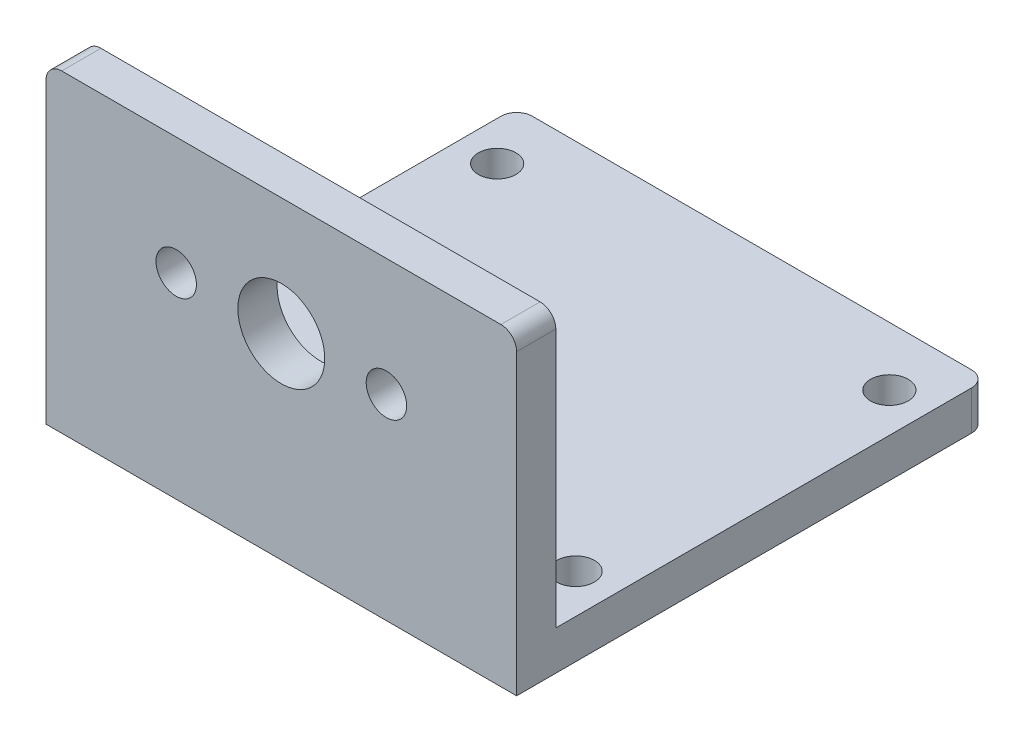
ISO-10303-21;
HEADER;
FILE_DESCRIPTION(('STEP AP214'),'2;1');
FILE_NAME('part.step','',(''),(''),'','','');
FILE_SCHEMA(('AUTOMOTIVE_DESIGN { 1 0 10303 214 1 1 1 1 }'));
ENDSEC;
DATA;
#1=APPLICATION_CONTEXT('core data for automotive mechanical design processes');
#2=APPLICATION_PROTOCOL_DEFINITION('international standard','automotive_design',2000,#1);
#3=PRODUCT_CONTEXT('',#1,'mechanical');
#4=PRODUCT('Part','Part','',(#3));
#5=PRODUCT_RELATED_PRODUCT_CATEGORY('part','',(#4));
#6=PRODUCT_DEFINITION_FORMATION('','',#4);
#7=PRODUCT_DEFINITION_CONTEXT('part definition',#1,'design');
#8=PRODUCT_DEFINITION('design','',#6,#7);
#9=PRODUCT_DEFINITION_SHAPE('','',#8);
#10=(LENGTH_UNIT() NAMED_UNIT(*) SI_UNIT(.MILLI.,.METRE.));
#11=(NAMED_UNIT(*) PLANE_ANGLE_UNIT() SI_UNIT($,.RADIAN.));
#12=(NAMED_UNIT(*) SI_UNIT($,.STERADIAN.) SOLID_ANGLE_UNIT());
#13=UNCERTAINTY_MEASURE_WITH_UNIT(LENGTH_MEASURE(1.E-05),#10,'distance_accuracy_value','');
#14=(GEOMETRIC_REPRESENTATION_CONTEXT(3) GLOBAL_UNCERTAINTY_ASSIGNED_CONTEXT((#13)) GLOBAL_UNIT_ASSIGNED_CONTEXT((#10,
#11,#12)) REPRESENTATION_CONTEXT('',''));
#15=CARTESIAN_POINT('',(0.,0.,0.));
#16=DIRECTION('',(0.,0.,1.));
#17=DIRECTION('',(1.,0.,0.));
#18=AXIS2_PLACEMENT_3D('',#15,#16,#17);
#19=CARTESIAN_POINT('',(38.1,25.4,0.));
#20=DIRECTION('',(0.,0.,-1.));
#21=DIRECTION('',(0.,1.,0.));
#22=AXIS2_PLACEMENT_3D('',#19,#20,#21);
#23=PLANE('',#22);
#24=CARTESIAN_POINT('',(27.559,15.875,0.));
#25=DIRECTION('',(0.,0.,-1.));
#26=DIRECTION('',(-1.,0.,0.));
#27=AXIS2_PLACEMENT_3D('',#24,#25,#26);
#28=CIRCLE('',#27,1.6383);
#29=CARTESIAN_POINT('',(25.9207,15.875,0.));
#30=VERTEX_POINT('',#29);
#31=EDGE_CURVE('E312',#30,#30,#28,.T.);
#32=ORIENTED_EDGE('',*,*,#31,.T.);
#33=EDGE_LOOP('',(#32));
#34=FACE_BOUND('',#33,.T.);
#35=CARTESIAN_POINT('',(10.541,15.875,0.));
#36=DIRECTION('',(0.,0.,-1.));
#37=DIRECTION('',(-1.,0.,0.));
#38=AXIS2_PLACEMENT_3D('',#35,#36,#37);
#39=CIRCLE('',#38,1.6383);
#40=CARTESIAN_POINT('',(8.9027,15.875,0.));
#41=VERTEX_POINT('',#40);
#42=EDGE_CURVE('E317',#41,#41,#39,.T.);
#43=ORIENTED_EDGE('',*,*,#42,.T.);
#44=EDGE_LOOP('',(#43));
#45=FACE_BOUND('',#44,.T.);
#46=CARTESIAN_POINT('',(19.05,15.875,0.));
#47=DIRECTION('',(0.,0.,-1.));
#48=DIRECTION('',(-1.,0.,0.));
#49=AXIS2_PLACEMENT_3D('',#46,#47,#48);
#50=CIRCLE('',#49,3.5179);
#51=CARTESIAN_POINT('',(15.5321,15.875,0.));
#52=VERTEX_POINT('',#51);
#53=EDGE_CURVE('E211',#52,#52,#50,.T.);
#54=ORIENTED_EDGE('',*,*,#53,.T.);
#55=EDGE_LOOP('',(#54));
#56=FACE_BOUND('',#55,.T.);
#57=DIRECTION('',(-1.,0.,0.));
#58=VECTOR('',#57,1.);
#59=CARTESIAN_POINT('',(38.1,25.4,0.));
#60=LINE('',#59,#58);
#61=CARTESIAN_POINT('',(36.83,25.4,0.));
#62=VERTEX_POINT('',#61);
#63=CARTESIAN_POINT('',(1.27000000000001,25.4,0.));
#64=VERTEX_POINT('',#63);
#65=EDGE_CURVE('E186',#62,#64,#60,.T.);
#66=ORIENTED_EDGE('',*,*,#65,.T.);
#67=CARTESIAN_POINT('',(1.27,24.13,0.));
#68=DIRECTION('',(0.,0.,-1.));
#69=DIRECTION('',(0.,1.,0.));
#70=AXIS2_PLACEMENT_3D('',#67,#68,#69);
#71=CIRCLE('',#70,1.27);
#72=CARTESIAN_POINT('',(0.,24.13,0.));
#73=VERTEX_POINT('',#72);
#74=EDGE_CURVE('E176',#64,#73,#71,.F.);
#75=ORIENTED_EDGE('',*,*,#74,.T.);
#76=DIRECTION('',(0.,-1.,0.));
#77=VECTOR('',#76,1.);
#78=CARTESIAN_POINT('',(0.,25.4,0.));
#79=LINE('',#78,#77);
#80=CARTESIAN_POINT('',(0.,0.,0.));
#81=VERTEX_POINT('',#80);
#82=EDGE_CURVE('E142',#73,#81,#79,.T.);
#83=ORIENTED_EDGE('',*,*,#82,.T.);
#84=DIRECTION('',(-1.,0.,0.));
#85=VECTOR('',#84,1.);
#86=CARTESIAN_POINT('',(38.1,0.,0.));
#87=LINE('',#86,#85);
#88=CARTESIAN_POINT('',(38.1,0.,0.));
#89=VERTEX_POINT('',#88);
#90=EDGE_CURVE('E134',#89,#81,#87,.T.);
#91=ORIENTED_EDGE('',*,*,#90,.F.);
#92=DIRECTION('',(0.,-1.,0.));
#93=VECTOR('',#92,1.);
#94=CARTESIAN_POINT('',(38.1,25.4,0.));
#95=LINE('',#94,#93);
#96=CARTESIAN_POINT('',(38.1,24.13,0.));
#97=VERTEX_POINT('',#96);
#98=EDGE_CURVE('E117',#97,#89,#95,.T.);
#99=ORIENTED_EDGE('',*,*,#98,.F.);
#100=CARTESIAN_POINT('',(36.83,24.13,0.));
#101=DIRECTION('',(0.,0.,-1.));
#102=DIRECTION('',(0.,1.,0.));
#103=AXIS2_PLACEMENT_3D('',#100,#101,#102);
#104=CIRCLE('',#103,1.27);
#105=EDGE_CURVE('E174',#97,#62,#104,.F.);
#106=ORIENTED_EDGE('',*,*,#105,.T.);
#107=EDGE_LOOP('',(#66,#75,#83,#91,#99,#106));
#108=FACE_BOUND('',#107,.T.);
#109=ADVANCED_FACE('F39',(#34,#45,#56,#108),#23,.F.);
#110=CARTESIAN_POINT('',(38.1,0.,0.));
#111=DIRECTION('',(0.,1.,0.));
#112=DIRECTION('',(0.,0.,1.));
#113=AXIS2_PLACEMENT_3D('',#110,#111,#112);
#114=PLANE('',#113);
#115=CARTESIAN_POINT('',(34.925,0.,-7.9502));
#116=DIRECTION('',(0.,1.,0.));
#117=DIRECTION('',(0.,0.,1.));
#118=AXIS2_PLACEMENT_3D('',#115,#116,#117);
#119=CIRCLE('',#118,1.524);
#120=CARTESIAN_POINT('',(34.925,0.,-6.42620000000001));
#121=VERTEX_POINT('',#120);
#122=EDGE_CURVE('E286',#121,#121,#119,.T.);
#123=ORIENTED_EDGE('',*,*,#122,.T.);
#124=EDGE_LOOP('',(#123));
#125=FACE_BOUND('',#124,.T.);
#126=CARTESIAN_POINT('',(34.925,0.,-33.3502));
#127=DIRECTION('',(0.,1.,0.));
#128=DIRECTION('',(0.,0.,1.));
#129=AXIS2_PLACEMENT_3D('',#126,#127,#128);
#130=CIRCLE('',#129,1.524);
#131=CARTESIAN_POINT('',(34.925,0.,-31.8262));
#132=VERTEX_POINT('',#131);
#133=EDGE_CURVE('E294',#132,#132,#130,.T.);
#134=ORIENTED_EDGE('',*,*,#133,.T.);
#135=EDGE_LOOP('',(#134));
#136=FACE_BOUND('',#135,.T.);
#137=CARTESIAN_POINT('',(3.175,0.,-33.3502));
#138=DIRECTION('',(0.,1.,0.));
#139=DIRECTION('',(0.,0.,1.));
#140=AXIS2_PLACEMENT_3D('',#137,#138,#139);
#141=CIRCLE('',#140,1.524);
#142=CARTESIAN_POINT('',(3.175,0.,-31.8262));
#143=VERTEX_POINT('',#142);
#144=EDGE_CURVE('E300',#143,#143,#141,.T.);
#145=ORIENTED_EDGE('',*,*,#144,.T.);
#146=EDGE_LOOP('',(#145));
#147=FACE_BOUND('',#146,.T.);
#148=CARTESIAN_POINT('',(3.175,0.,-7.9502));
#149=DIRECTION('',(0.,1.,0.));
#150=DIRECTION('',(0.,0.,1.));
#151=AXIS2_PLACEMENT_3D('',#148,#149,#150);
#152=CIRCLE('',#151,1.524);
#153=CARTESIAN_POINT('',(3.175,0.,-6.4262));
#154=VERTEX_POINT('',#153);
#155=EDGE_CURVE('E306',#154,#154,#152,.T.);
#156=ORIENTED_EDGE('',*,*,#155,.T.);
#157=EDGE_LOOP('',(#156));
#158=FACE_BOUND('',#157,.T.);
#159=DIRECTION('',(0.,0.,-1.));
#160=VECTOR('',#159,1.);
#161=CARTESIAN_POINT('',(0.,0.,0.));
#162=LINE('',#161,#160);
#163=CARTESIAN_POINT('',(0.,0.,-36.83));
#164=VERTEX_POINT('',#163);
#165=EDGE_CURVE('E210',#81,#164,#162,.T.);
#166=ORIENTED_EDGE('',*,*,#165,.T.);
#167=CARTESIAN_POINT('',(1.27,0.,-36.83));
#168=DIRECTION('',(0.,1.,0.));
#169=DIRECTION('',(0.,0.,1.));
#170=AXIS2_PLACEMENT_3D('',#167,#168,#169);
#171=CIRCLE('',#170,1.27);
#172=CARTESIAN_POINT('',(1.27000000000001,0.,-38.1));
#173=VERTEX_POINT('',#172);
#174=EDGE_CURVE('E165',#164,#173,#171,.F.);
#175=ORIENTED_EDGE('',*,*,#174,.T.);
#176=DIRECTION('',(-1.,0.,0.));
#177=VECTOR('',#176,1.);
#178=CARTESIAN_POINT('',(38.1,0.,-38.1));
#179=LINE('',#178,#177);
#180=CARTESIAN_POINT('',(36.83,0.,-38.1));
#181=VERTEX_POINT('',#180);
#182=EDGE_CURVE('E145',#181,#173,#179,.T.);
#183=ORIENTED_EDGE('',*,*,#182,.F.);
#184=CARTESIAN_POINT('',(36.83,0.,-36.83));
#185=DIRECTION('',(0.,1.,0.));
#186=DIRECTION('',(0.,0.,1.));
#187=AXIS2_PLACEMENT_3D('',#184,#185,#186);
#188=CIRCLE('',#187,1.27);
#189=CARTESIAN_POINT('',(38.1,0.,-36.83));
#190=VERTEX_POINT('',#189);
#191=EDGE_CURVE('E137',#181,#190,#188,.F.);
#192=ORIENTED_EDGE('',*,*,#191,.T.);
#193=DIRECTION('',(0.,0.,-1.));
#194=VECTOR('',#193,1.);
#195=CARTESIAN_POINT('',(38.1,0.,0.));
#196=LINE('',#195,#194);
#197=EDGE_CURVE('E121',#89,#190,#196,.T.);
#198=ORIENTED_EDGE('',*,*,#197,.F.);
#199=ORIENTED_EDGE('',*,*,#90,.T.);
#200=EDGE_LOOP('',(#166,#175,#183,#192,#198,#199));
#201=FACE_BOUND('',#200,.T.);
#202=ADVANCED_FACE('F133',(#125,#136,#147,#158,#201),#114,.F.);
#203=CARTESIAN_POINT('',(38.1,0.,-38.1));
#204=DIRECTION('',(0.,0.,1.));
#205=DIRECTION('',(1.,0.,0.));
#206=AXIS2_PLACEMENT_3D('',#203,#204,#205);
#207=PLANE('',#206);
#208=ORIENTED_EDGE('',*,*,#182,.T.);
#209=DIRECTION('',(0.,1.,0.));
#210=VECTOR('',#209,1.);
#211=CARTESIAN_POINT('',(1.27,0.,-38.1));
#212=LINE('',#211,#210);
#213=CARTESIAN_POINT('',(1.27000000000001,3.175,-38.1));
#214=VERTEX_POINT('',#213);
#215=EDGE_CURVE('E147',#173,#214,#212,.T.);
#216=ORIENTED_EDGE('',*,*,#215,.T.);
#217=DIRECTION('',(-1.,0.,0.));
#218=VECTOR('',#217,1.);
#219=CARTESIAN_POINT('',(38.1,3.175,-38.1));
#220=LINE('',#219,#218);
#221=CARTESIAN_POINT('',(36.83,3.175,-38.1));
#222=VERTEX_POINT('',#221);
#223=EDGE_CURVE('E150',#222,#214,#220,.T.);
#224=ORIENTED_EDGE('',*,*,#223,.F.);
#225=DIRECTION('',(0.,1.,0.));
#226=VECTOR('',#225,1.);
#227=CARTESIAN_POINT('',(36.83,0.,-38.1));
#228=LINE('',#227,#226);
#229=EDGE_CURVE('E144',#222,#181,#228,.F.);
#230=ORIENTED_EDGE('',*,*,#229,.T.);
#231=EDGE_LOOP('',(#208,#216,#224,#230));
#232=FACE_BOUND('',#231,.T.);
#233=ADVANCED_FACE('F203',(#232),#207,.F.);
#234=CARTESIAN_POINT('',(38.1,3.175,-38.1));
#235=DIRECTION('',(0.,-1.,0.));
#236=DIRECTION('',(0.,0.,-1.));
#237=AXIS2_PLACEMENT_3D('',#234,#235,#236);
#238=PLANE('',#237);
#239=CARTESIAN_POINT('',(34.925,3.175,-7.9502));
#240=DIRECTION('',(0.,1.,0.));
#241=DIRECTION('',(0.,0.,1.));
#242=AXIS2_PLACEMENT_3D('',#239,#240,#241);
#243=CIRCLE('',#242,1.524);
#244=CARTESIAN_POINT('',(34.925,3.175,-6.42620000000001));
#245=VERTEX_POINT('',#244);
#246=EDGE_CURVE('E289',#245,#245,#243,.T.);
#247=ORIENTED_EDGE('',*,*,#246,.F.);
#248=EDGE_LOOP('',(#247));
#249=FACE_BOUND('',#248,.T.);
#250=CARTESIAN_POINT('',(34.925,3.175,-33.3502));
#251=DIRECTION('',(0.,1.,0.));
#252=DIRECTION('',(0.,0.,1.));
#253=AXIS2_PLACEMENT_3D('',#250,#251,#252);
#254=CIRCLE('',#253,1.524);
#255=CARTESIAN_POINT('',(34.925,3.175,-31.8262));
#256=VERTEX_POINT('',#255);
#257=EDGE_CURVE('E291',#256,#256,#254,.T.);
#258=ORIENTED_EDGE('',*,*,#257,.F.);
#259=EDGE_LOOP('',(#258));
#260=FACE_BOUND('',#259,.T.);
#261=CARTESIAN_POINT('',(3.175,3.175,-33.3502));
#262=DIRECTION('',(0.,1.,0.));
#263=DIRECTION('',(0.,0.,1.));
#264=AXIS2_PLACEMENT_3D('',#261,#262,#263);
#265=CIRCLE('',#264,1.524);
#266=CARTESIAN_POINT('',(3.175,3.175,-31.8262));
#267=VERTEX_POINT('',#266);
#268=EDGE_CURVE('E297',#267,#267,#265,.T.);
#269=ORIENTED_EDGE('',*,*,#268,.F.);
#270=EDGE_LOOP('',(#269));
#271=FACE_BOUND('',#270,.T.);
#272=CARTESIAN_POINT('',(3.175,3.175,-7.9502));
#273=DIRECTION('',(0.,1.,0.));
#274=DIRECTION('',(0.,0.,1.));
#275=AXIS2_PLACEMENT_3D('',#272,#273,#274);
#276=CIRCLE('',#275,1.524);
#277=CARTESIAN_POINT('',(3.175,3.175,-6.4262));
#278=VERTEX_POINT('',#277);
#279=EDGE_CURVE('E303',#278,#278,#276,.T.);
#280=ORIENTED_EDGE('',*,*,#279,.F.);
#281=EDGE_LOOP('',(#280));
#282=FACE_BOUND('',#281,.T.);
#283=ORIENTED_EDGE('',*,*,#223,.T.);
#284=CARTESIAN_POINT('',(1.27,3.175,-36.83));
#285=DIRECTION('',(0.,-1.,0.));
#286=DIRECTION('',(0.,0.,-1.));
#287=AXIS2_PLACEMENT_3D('',#284,#285,#286);
#288=CIRCLE('',#287,1.27);
#289=CARTESIAN_POINT('',(0.,3.175,-36.83));
#290=VERTEX_POINT('',#289);
#291=EDGE_CURVE('E158',#214,#290,#288,.F.);
#292=ORIENTED_EDGE('',*,*,#291,.T.);
#293=DIRECTION('',(0.,0.,1.));
#294=VECTOR('',#293,1.);
#295=CARTESIAN_POINT('',(0.,3.175,-38.1));
#296=LINE('',#295,#294);
#297=CARTESIAN_POINT('',(0.,3.175,-3.175));
#298=VERTEX_POINT('',#297);
#299=EDGE_CURVE('E212',#290,#298,#296,.T.);
#300=ORIENTED_EDGE('',*,*,#299,.T.);
#301=DIRECTION('',(-1.,0.,0.));
#302=VECTOR('',#301,1.);
#303=CARTESIAN_POINT('',(38.1,3.175,-3.175));
#304=LINE('',#303,#302);
#305=CARTESIAN_POINT('',(38.1,3.175,-3.175));
#306=VERTEX_POINT('',#305);
#307=EDGE_CURVE('E191',#306,#298,#304,.T.);
#308=ORIENTED_EDGE('',*,*,#307,.F.);
#309=DIRECTION('',(0.,0.,1.));
#310=VECTOR('',#309,1.);
#311=CARTESIAN_POINT('',(38.1,3.175,-38.1));
#312=LINE('',#311,#310);
#313=CARTESIAN_POINT('',(38.1,3.175,-36.83));
#314=VERTEX_POINT('',#313);
#315=EDGE_CURVE('E138',#314,#306,#312,.T.);
#316=ORIENTED_EDGE('',*,*,#315,.F.);
#317=CARTESIAN_POINT('',(36.83,3.175,-36.83));
#318=DIRECTION('',(0.,-1.,0.));
#319=DIRECTION('',(0.,0.,-1.));
#320=AXIS2_PLACEMENT_3D('',#317,#318,#319);
#321=CIRCLE('',#320,1.27);
#322=EDGE_CURVE('E156',#314,#222,#321,.F.);
#323=ORIENTED_EDGE('',*,*,#322,.T.);
#324=EDGE_LOOP('',(#283,#292,#300,#308,#316,#323));
#325=FACE_BOUND('',#324,.T.);
#326=ADVANCED_FACE('F199',(#249,#260,#271,#282,#325),#238,.F.);
#327=CARTESIAN_POINT('',(38.1,3.175,-3.175));
#328=DIRECTION('',(0.,0.,1.));
#329=DIRECTION('',(1.,0.,0.));
#330=AXIS2_PLACEMENT_3D('',#327,#328,#329);
#331=PLANE('',#330);
#332=CARTESIAN_POINT('',(27.559,15.875,-3.175));
#333=DIRECTION('',(0.,0.,-1.));
#334=DIRECTION('',(-1.,0.,0.));
#335=AXIS2_PLACEMENT_3D('',#332,#333,#334);
#336=CIRCLE('',#335,1.6383);
#337=CARTESIAN_POINT('',(25.9207,15.875,-3.175));
#338=VERTEX_POINT('',#337);
#339=EDGE_CURVE('E309',#338,#338,#336,.T.);
#340=ORIENTED_EDGE('',*,*,#339,.F.);
#341=EDGE_LOOP('',(#340));
#342=FACE_BOUND('',#341,.T.);
#343=CARTESIAN_POINT('',(10.541,15.875,-3.175));
#344=DIRECTION('',(0.,0.,-1.));
#345=DIRECTION('',(-1.,0.,0.));
#346=AXIS2_PLACEMENT_3D('',#343,#344,#345);
#347=CIRCLE('',#346,1.6383);
#348=CARTESIAN_POINT('',(8.9027,15.875,-3.175));
#349=VERTEX_POINT('',#348);
#350=EDGE_CURVE('E314',#349,#349,#347,.T.);
#351=ORIENTED_EDGE('',*,*,#350,.F.);
#352=EDGE_LOOP('',(#351));
#353=FACE_BOUND('',#352,.T.);
#354=CARTESIAN_POINT('',(19.05,15.875,-3.175));
#355=DIRECTION('',(0.,0.,-1.));
#356=DIRECTION('',(-1.,0.,0.));
#357=AXIS2_PLACEMENT_3D('',#354,#355,#356);
#358=CIRCLE('',#357,3.5179);
#359=CARTESIAN_POINT('',(15.5321,15.875,-3.175));
#360=VERTEX_POINT('',#359);
#361=EDGE_CURVE('E320',#360,#360,#358,.T.);
#362=ORIENTED_EDGE('',*,*,#361,.F.);
#363=EDGE_LOOP('',(#362));
#364=FACE_BOUND('',#363,.T.);
#365=DIRECTION('',(0.,1.,0.));
#366=VECTOR('',#365,1.);
#367=CARTESIAN_POINT('',(0.,3.175,-3.175));
#368=LINE('',#367,#366);
#369=CARTESIAN_POINT('',(0.,24.13,-3.175));
#370=VERTEX_POINT('',#369);
#371=EDGE_CURVE('E128',#298,#370,#368,.T.);
#372=ORIENTED_EDGE('',*,*,#371,.T.);
#373=CARTESIAN_POINT('',(1.27,24.13,-3.175));
#374=DIRECTION('',(0.,0.,1.));
#375=DIRECTION('',(1.,0.,0.));
#376=AXIS2_PLACEMENT_3D('',#373,#374,#375);
#377=CIRCLE('',#376,1.27);
#378=CARTESIAN_POINT('',(1.27000000000001,25.4,-3.175));
#379=VERTEX_POINT('',#378);
#380=EDGE_CURVE('E11',#370,#379,#377,.F.);
#381=ORIENTED_EDGE('',*,*,#380,.T.);
#382=DIRECTION('',(-1.,0.,0.));
#383=VECTOR('',#382,1.);
#384=CARTESIAN_POINT('',(38.1,25.4,-3.175));
#385=LINE('',#384,#383);
#386=CARTESIAN_POINT('',(36.83,25.4,-3.175));
#387=VERTEX_POINT('',#386);
#388=EDGE_CURVE('E182',#387,#379,#385,.T.);
#389=ORIENTED_EDGE('',*,*,#388,.F.);
#390=CARTESIAN_POINT('',(36.83,24.13,-3.175));
#391=DIRECTION('',(0.,0.,1.));
#392=DIRECTION('',(1.,0.,0.));
#393=AXIS2_PLACEMENT_3D('',#390,#391,#392);
#394=CIRCLE('',#393,1.27);
#395=CARTESIAN_POINT('',(38.1,24.13,-3.175));
#396=VERTEX_POINT('',#395);
#397=EDGE_CURVE('E47',#387,#396,#394,.F.);
#398=ORIENTED_EDGE('',*,*,#397,.T.);
#399=DIRECTION('',(0.,1.,0.));
#400=VECTOR('',#399,1.);
#401=CARTESIAN_POINT('',(38.1,3.175,-3.175));
#402=LINE('',#401,#400);
#403=EDGE_CURVE('E181',#306,#396,#402,.T.);
#404=ORIENTED_EDGE('',*,*,#403,.F.);
#405=ORIENTED_EDGE('',*,*,#307,.T.);
#406=EDGE_LOOP('',(#372,#381,#389,#398,#404,#405));
#407=FACE_BOUND('',#406,.T.);
#408=ADVANCED_FACE('F179',(#342,#353,#364,#407),#331,.F.);
#409=CARTESIAN_POINT('',(38.1,25.4,-3.175));
#410=DIRECTION('',(0.,-1.,0.));
#411=DIRECTION('',(0.,0.,-1.));
#412=AXIS2_PLACEMENT_3D('',#409,#410,#411);
#413=PLANE('',#412);
#414=ORIENTED_EDGE('',*,*,#388,.T.);
#415=DIRECTION('',(0.,0.,1.));
#416=VECTOR('',#415,1.);
#417=CARTESIAN_POINT('',(1.27,25.4,-3.175));
#418=LINE('',#417,#416);
#419=EDGE_CURVE('E171',#379,#64,#418,.T.);
#420=ORIENTED_EDGE('',*,*,#419,.T.);
#421=ORIENTED_EDGE('',*,*,#65,.F.);
#422=DIRECTION('',(0.,0.,1.));
#423=VECTOR('',#422,1.);
#424=CARTESIAN_POINT('',(36.83,25.4,-3.175));
#425=LINE('',#424,#423);
#426=EDGE_CURVE('E59',#62,#387,#425,.F.);
#427=ORIENTED_EDGE('',*,*,#426,.T.);
#428=EDGE_LOOP('',(#414,#420,#421,#427));
#429=FACE_BOUND('',#428,.T.);
#430=ADVANCED_FACE('F188',(#429),#413,.F.);
#431=CARTESIAN_POINT('',(38.1,0.,0.));
#432=DIRECTION('',(1.,0.,0.));
#433=DIRECTION('',(0.,0.,-1.));
#434=AXIS2_PLACEMENT_3D('',#431,#432,#433);
#435=PLANE('',#434);
#436=ORIENTED_EDGE('',*,*,#197,.T.);
#437=DIRECTION('',(0.,1.,0.));
#438=VECTOR('',#437,1.);
#439=CARTESIAN_POINT('',(38.1,3.175,-36.83));
#440=LINE('',#439,#438);
#441=EDGE_CURVE('E168',#190,#314,#440,.T.);
#442=ORIENTED_EDGE('',*,*,#441,.T.);
#443=ORIENTED_EDGE('',*,*,#315,.T.);
#444=ORIENTED_EDGE('',*,*,#403,.T.);
#445=DIRECTION('',(0.,0.,1.));
#446=VECTOR('',#445,1.);
#447=CARTESIAN_POINT('',(38.1,24.13,0.));
#448=LINE('',#447,#446);
#449=EDGE_CURVE('E125',#396,#97,#448,.T.);
#450=ORIENTED_EDGE('',*,*,#449,.T.);
#451=ORIENTED_EDGE('',*,*,#98,.T.);
#452=EDGE_LOOP('',(#436,#442,#443,#444,#450,#451));
#453=FACE_BOUND('',#452,.T.);
#454=ADVANCED_FACE('F119',(#453),#435,.T.);
#455=CARTESIAN_POINT('',(0.,0.,0.));
#456=DIRECTION('',(1.,0.,0.));
#457=DIRECTION('',(0.,0.,-1.));
#458=AXIS2_PLACEMENT_3D('',#455,#456,#457);
#459=PLANE('',#458);
#460=ORIENTED_EDGE('',*,*,#299,.F.);
#461=DIRECTION('',(0.,1.,0.));
#462=VECTOR('',#461,1.);
#463=CARTESIAN_POINT('',(0.,0.,-36.83));
#464=LINE('',#463,#462);
#465=EDGE_CURVE('E162',#290,#164,#464,.F.);
#466=ORIENTED_EDGE('',*,*,#465,.T.);
#467=ORIENTED_EDGE('',*,*,#165,.F.);
#468=ORIENTED_EDGE('',*,*,#82,.F.);
#469=DIRECTION('',(0.,0.,1.));
#470=VECTOR('',#469,1.);
#471=CARTESIAN_POINT('',(0.,24.13,0.));
#472=LINE('',#471,#470);
#473=EDGE_CURVE('E160',#73,#370,#472,.F.);
#474=ORIENTED_EDGE('',*,*,#473,.T.);
#475=ORIENTED_EDGE('',*,*,#371,.F.);
#476=EDGE_LOOP('',(#460,#466,#467,#468,#474,#475));
#477=FACE_BOUND('',#476,.T.);
#478=ADVANCED_FACE('F218',(#477),#459,.F.);
#479=CARTESIAN_POINT('',(19.05,15.875,0.));
#480=DIRECTION('',(0.,0.,-1.));
#481=DIRECTION('',(-1.,0.,0.));
#482=AXIS2_PLACEMENT_3D('',#479,#480,#481);
#483=CYLINDRICAL_SURFACE('',#482,3.5179);
#484=ORIENTED_EDGE('',*,*,#53,.F.);
#485=EDGE_LOOP('',(#484));
#486=FACE_BOUND('',#485,.T.);
#487=ORIENTED_EDGE('',*,*,#361,.T.);
#488=EDGE_LOOP('',(#487));
#489=FACE_BOUND('',#488,.T.);
#490=ADVANCED_FACE('F257',(#486,#489),#483,.F.);
#491=CARTESIAN_POINT('',(10.541,15.875,0.));
#492=DIRECTION('',(0.,0.,-1.));
#493=DIRECTION('',(-1.,0.,0.));
#494=AXIS2_PLACEMENT_3D('',#491,#492,#493);
#495=CYLINDRICAL_SURFACE('',#494,1.6383);
#496=ORIENTED_EDGE('',*,*,#42,.F.);
#497=EDGE_LOOP('',(#496));
#498=FACE_BOUND('',#497,.T.);
#499=ORIENTED_EDGE('',*,*,#350,.T.);
#500=EDGE_LOOP('',(#499));
#501=FACE_BOUND('',#500,.T.);
#502=ADVANCED_FACE('F232',(#498,#501),#495,.F.);
#503=CARTESIAN_POINT('',(27.559,15.875,0.));
#504=DIRECTION('',(0.,0.,-1.));
#505=DIRECTION('',(-1.,0.,0.));
#506=AXIS2_PLACEMENT_3D('',#503,#504,#505);
#507=CYLINDRICAL_SURFACE('',#506,1.6383);
#508=ORIENTED_EDGE('',*,*,#31,.F.);
#509=EDGE_LOOP('',(#508));
#510=FACE_BOUND('',#509,.T.);
#511=ORIENTED_EDGE('',*,*,#339,.T.);
#512=EDGE_LOOP('',(#511));
#513=FACE_BOUND('',#512,.T.);
#514=ADVANCED_FACE('F224',(#510,#513),#507,.F.);
#515=CARTESIAN_POINT('',(1.27,0.,-36.83));
#516=DIRECTION('',(0.,1.,0.));
#517=DIRECTION('',(0.,0.,1.));
#518=AXIS2_PLACEMENT_3D('',#515,#516,#517);
#519=CYLINDRICAL_SURFACE('',#518,1.27);
#520=ORIENTED_EDGE('',*,*,#174,.F.);
#521=ORIENTED_EDGE('',*,*,#465,.F.);
#522=ORIENTED_EDGE('',*,*,#291,.F.);
#523=ORIENTED_EDGE('',*,*,#215,.F.);
#524=EDGE_LOOP('',(#520,#521,#522,#523));
#525=FACE_BOUND('',#524,.T.);
#526=ADVANCED_FACE('F222',(#525),#519,.T.);
#527=CARTESIAN_POINT('',(36.83,0.,-36.83));
#528=DIRECTION('',(0.,-1.,0.));
#529=DIRECTION('',(0.,0.,-1.));
#530=AXIS2_PLACEMENT_3D('',#527,#528,#529);
#531=CYLINDRICAL_SURFACE('',#530,1.27);
#532=ORIENTED_EDGE('',*,*,#191,.F.);
#533=ORIENTED_EDGE('',*,*,#229,.F.);
#534=ORIENTED_EDGE('',*,*,#322,.F.);
#535=ORIENTED_EDGE('',*,*,#441,.F.);
#536=EDGE_LOOP('',(#532,#533,#534,#535));
#537=FACE_BOUND('',#536,.T.);
#538=ADVANCED_FACE('F206',(#537),#531,.T.);
#539=CARTESIAN_POINT('',(1.27,24.13,-3.175));
#540=DIRECTION('',(0.,0.,1.));
#541=DIRECTION('',(1.,0.,0.));
#542=AXIS2_PLACEMENT_3D('',#539,#540,#541);
#543=CYLINDRICAL_SURFACE('',#542,1.27);
#544=ORIENTED_EDGE('',*,*,#380,.F.);
#545=ORIENTED_EDGE('',*,*,#473,.F.);
#546=ORIENTED_EDGE('',*,*,#74,.F.);
#547=ORIENTED_EDGE('',*,*,#419,.F.);
#548=EDGE_LOOP('',(#544,#545,#546,#547));
#549=FACE_BOUND('',#548,.T.);
#550=ADVANCED_FACE('F217',(#549),#543,.T.);
#551=CARTESIAN_POINT('',(36.83,24.13,0.));
#552=DIRECTION('',(0.,0.,-1.));
#553=DIRECTION('',(-1.,0.,0.));
#554=AXIS2_PLACEMENT_3D('',#551,#552,#553);
#555=CYLINDRICAL_SURFACE('',#554,1.27);
#556=ORIENTED_EDGE('',*,*,#397,.F.);
#557=ORIENTED_EDGE('',*,*,#426,.F.);
#558=ORIENTED_EDGE('',*,*,#105,.F.);
#559=ORIENTED_EDGE('',*,*,#449,.F.);
#560=EDGE_LOOP('',(#556,#557,#558,#559));
#561=FACE_BOUND('',#560,.T.);
#562=ADVANCED_FACE('F41',(#561),#555,.T.);
#563=CARTESIAN_POINT('',(3.175,0.,-7.9502));
#564=DIRECTION('',(0.,1.,0.));
#565=DIRECTION('',(0.,0.,1.));
#566=AXIS2_PLACEMENT_3D('',#563,#564,#565);
#567=CYLINDRICAL_SURFACE('',#566,1.524);
#568=ORIENTED_EDGE('',*,*,#155,.F.);
#569=EDGE_LOOP('',(#568));
#570=FACE_BOUND('',#569,.T.);
#571=ORIENTED_EDGE('',*,*,#279,.T.);
#572=EDGE_LOOP('',(#571));
#573=FACE_BOUND('',#572,.T.);
#574=ADVANCED_FACE('F266',(#570,#573),#567,.F.);
#575=CARTESIAN_POINT('',(3.175,0.,-33.3502));
#576=DIRECTION('',(0.,1.,0.));
#577=DIRECTION('',(0.,0.,1.));
#578=AXIS2_PLACEMENT_3D('',#575,#576,#577);
#579=CYLINDRICAL_SURFACE('',#578,1.524);
#580=ORIENTED_EDGE('',*,*,#144,.F.);
#581=EDGE_LOOP('',(#580));
#582=FACE_BOUND('',#581,.T.);
#583=ORIENTED_EDGE('',*,*,#268,.T.);
#584=EDGE_LOOP('',(#583));
#585=FACE_BOUND('',#584,.T.);
#586=ADVANCED_FACE('F269',(#582,#585),#579,.F.);
#587=CARTESIAN_POINT('',(34.925,0.,-33.3502));
#588=DIRECTION('',(0.,1.,0.));
#589=DIRECTION('',(0.,0.,1.));
#590=AXIS2_PLACEMENT_3D('',#587,#588,#589);
#591=CYLINDRICAL_SURFACE('',#590,1.524);
#592=ORIENTED_EDGE('',*,*,#133,.F.);
#593=EDGE_LOOP('',(#592));
#594=FACE_BOUND('',#593,.T.);
#595=ORIENTED_EDGE('',*,*,#257,.T.);
#596=EDGE_LOOP('',(#595));
#597=FACE_BOUND('',#596,.T.);
#598=ADVANCED_FACE('F273',(#594,#597),#591,.F.);
#599=CARTESIAN_POINT('',(34.925,0.,-7.9502));
#600=DIRECTION('',(0.,1.,0.));
#601=DIRECTION('',(0.,0.,1.));
#602=AXIS2_PLACEMENT_3D('',#599,#600,#601);
#603=CYLINDRICAL_SURFACE('',#602,1.524);
#604=ORIENTED_EDGE('',*,*,#122,.F.);
#605=EDGE_LOOP('',(#604));
#606=FACE_BOUND('',#605,.T.);
#607=ORIENTED_EDGE('',*,*,#246,.T.);
#608=EDGE_LOOP('',(#607));
#609=FACE_BOUND('',#608,.T.);
#610=ADVANCED_FACE('F277',(#606,#609),#603,.F.);
#611=CLOSED_SHELL('',(#109,#202,#233,#326,#408,#430,#454,#478,#490,#502,#514,#526,#538,#550,
#562,#574,#586,#598,#610));
#612=MANIFOLD_SOLID_BREP('B2',#611);
#613=ADVANCED_BREP_SHAPE_REPRESENTATION('',(#18,#612),#14);
#614=SHAPE_DEFINITION_REPRESENTATION(#9,#613);
ENDSEC;
END-ISO-10303-21;
